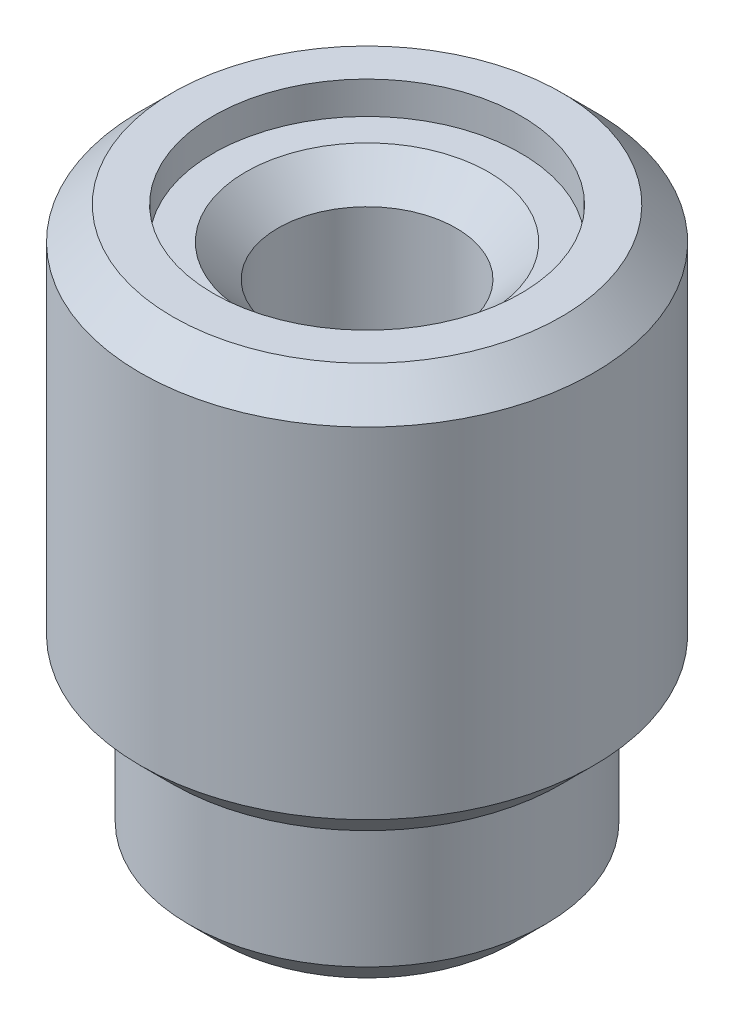
ISO-10303-21;
HEADER;
FILE_DESCRIPTION(('STEP AP214'),'2;1');
FILE_NAME('part.step','',(''),(''),'','','');
FILE_SCHEMA(('AUTOMOTIVE_DESIGN { 1 0 10303 214 1 1 1 1 }'));
ENDSEC;
DATA;
#1=APPLICATION_CONTEXT('core data for automotive mechanical design processes');
#2=APPLICATION_PROTOCOL_DEFINITION('international standard','automotive_design',2000,#1);
#3=PRODUCT_CONTEXT('',#1,'mechanical');
#4=PRODUCT('Part','Part','',(#3));
#5=PRODUCT_RELATED_PRODUCT_CATEGORY('part','',(#4));
#6=PRODUCT_DEFINITION_FORMATION('','',#4);
#7=PRODUCT_DEFINITION_CONTEXT('part definition',#1,'design');
#8=PRODUCT_DEFINITION('design','',#6,#7);
#9=PRODUCT_DEFINITION_SHAPE('','',#8);
#10=(LENGTH_UNIT() NAMED_UNIT(*) SI_UNIT(.MILLI.,.METRE.));
#11=(NAMED_UNIT(*) PLANE_ANGLE_UNIT() SI_UNIT($,.RADIAN.));
#12=(NAMED_UNIT(*) SI_UNIT($,.STERADIAN.) SOLID_ANGLE_UNIT());
#13=UNCERTAINTY_MEASURE_WITH_UNIT(LENGTH_MEASURE(1.E-05),#10,'distance_accuracy_value','');
#14=(GEOMETRIC_REPRESENTATION_CONTEXT(3) GLOBAL_UNCERTAINTY_ASSIGNED_CONTEXT((#13)) GLOBAL_UNIT_ASSIGNED_CONTEXT((#10,
#11,#12)) REPRESENTATION_CONTEXT('',''));
#15=CARTESIAN_POINT('',(0.,0.,0.));
#16=DIRECTION('',(0.,0.,1.));
#17=DIRECTION('',(1.,0.,0.));
#18=AXIS2_PLACEMENT_3D('',#15,#16,#17);
#19=CARTESIAN_POINT('',(0.,0.,0.));
#20=DIRECTION('',(0.,1.,0.));
#21=DIRECTION('',(0.,0.,1.));
#22=AXIS2_PLACEMENT_3D('',#19,#20,#21);
#23=CYLINDRICAL_SURFACE('',#22,1.397);
#24=CARTESIAN_POINT('',(0.,7.874,0.));
#25=DIRECTION('',(0.,1.,0.));
#26=DIRECTION('',(0.,0.,1.));
#27=AXIS2_PLACEMENT_3D('',#24,#25,#26);
#28=CIRCLE('',#27,1.397);
#29=CARTESIAN_POINT('',(0.,7.874,1.397));
#30=VERTEX_POINT('',#29);
#31=EDGE_CURVE('E11',#30,#30,#28,.T.);
#32=ORIENTED_EDGE('',*,*,#31,.T.);
#33=EDGE_LOOP('',(#32));
#34=FACE_BOUND('',#33,.T.);
#35=CARTESIAN_POINT('',(0.,5.08,0.));
#36=DIRECTION('',(0.,-1.,0.));
#37=DIRECTION('',(0.,0.,-1.));
#38=AXIS2_PLACEMENT_3D('',#35,#36,#37);
#39=CIRCLE('',#38,1.397);
#40=CARTESIAN_POINT('',(0.,5.08,-1.397));
#41=VERTEX_POINT('',#40);
#42=EDGE_CURVE('E95',#41,#41,#39,.F.);
#43=ORIENTED_EDGE('',*,*,#42,.F.);
#44=EDGE_LOOP('',(#43));
#45=FACE_BOUND('',#44,.T.);
#46=ADVANCED_FACE('F56',(#34,#45),#23,.F.);
#47=CARTESIAN_POINT('',(0.,2.54,0.));
#48=DIRECTION('',(0.,-1.,0.));
#49=DIRECTION('',(0.,0.,-1.));
#50=AXIS2_PLACEMENT_3D('',#47,#48,#49);
#51=CYLINDRICAL_SURFACE('',#50,2.794);
#52=CARTESIAN_POINT('',(0.,0.507999999999998,0.));
#53=DIRECTION('',(0.,1.,0.));
#54=DIRECTION('',(0.,0.,1.));
#55=AXIS2_PLACEMENT_3D('',#52,#53,#54);
#56=CIRCLE('',#55,2.794);
#57=CARTESIAN_POINT('',(0.,0.507999999999998,2.794));
#58=VERTEX_POINT('',#57);
#59=EDGE_CURVE('E91',#58,#58,#56,.T.);
#60=ORIENTED_EDGE('',*,*,#59,.T.);
#61=EDGE_LOOP('',(#60));
#62=FACE_BOUND('',#61,.T.);
#63=CARTESIAN_POINT('',(0.,2.54,0.));
#64=DIRECTION('',(0.,1.,0.));
#65=DIRECTION('',(0.,0.,1.));
#66=AXIS2_PLACEMENT_3D('',#63,#64,#65);
#67=CIRCLE('',#66,2.794);
#68=CARTESIAN_POINT('',(0.,2.54,2.794));
#69=VERTEX_POINT('',#68);
#70=EDGE_CURVE('E94',#69,#69,#67,.T.);
#71=ORIENTED_EDGE('',*,*,#70,.F.);
#72=EDGE_LOOP('',(#71));
#73=FACE_BOUND('',#72,.T.);
#74=ADVANCED_FACE('F129',(#62,#73),#51,.T.);
#75=CARTESIAN_POINT('',(0.,0.,0.));
#76=DIRECTION('',(0.,1.,0.));
#77=DIRECTION('',(0.,0.,1.));
#78=AXIS2_PLACEMENT_3D('',#75,#76,#77);
#79=PLANE('',#78);
#80=CARTESIAN_POINT('',(0.,0.,0.));
#81=DIRECTION('',(0.,1.,0.));
#82=DIRECTION('',(0.,0.,1.));
#83=AXIS2_PLACEMENT_3D('',#80,#81,#82);
#84=CIRCLE('',#83,2.2479);
#85=CARTESIAN_POINT('',(0.,0.,2.2479));
#86=VERTEX_POINT('',#85);
#87=EDGE_CURVE('E67',#86,#86,#84,.T.);
#88=ORIENTED_EDGE('',*,*,#87,.T.);
#89=EDGE_LOOP('',(#88));
#90=FACE_BOUND('',#89,.T.);
#91=CARTESIAN_POINT('',(0.,0.,0.));
#92=DIRECTION('',(0.,1.,0.));
#93=DIRECTION('',(0.,0.,1.));
#94=AXIS2_PLACEMENT_3D('',#91,#92,#93);
#95=CIRCLE('',#94,2.286);
#96=CARTESIAN_POINT('',(0.,0.,2.286));
#97=VERTEX_POINT('',#96);
#98=EDGE_CURVE('E88',#97,#97,#95,.F.);
#99=ORIENTED_EDGE('',*,*,#98,.T.);
#100=EDGE_LOOP('',(#99));
#101=FACE_BOUND('',#100,.T.);
#102=ADVANCED_FACE('F134',(#90,#101),#79,.F.);
#103=CARTESIAN_POINT('',(0.,2.54,0.));
#104=DIRECTION('',(0.,1.,0.));
#105=DIRECTION('',(0.,0.,1.));
#106=AXIS2_PLACEMENT_3D('',#103,#104,#105);
#107=PLANE('',#106);
#108=CARTESIAN_POINT('',(0.,2.54,0.));
#109=DIRECTION('',(0.,1.,0.));
#110=DIRECTION('',(0.,0.,1.));
#111=AXIS2_PLACEMENT_3D('',#108,#109,#110);
#112=CIRCLE('',#111,3.048);
#113=CARTESIAN_POINT('',(0.,2.54,3.048));
#114=VERTEX_POINT('',#113);
#115=EDGE_CURVE('E79',#114,#114,#112,.F.);
#116=ORIENTED_EDGE('',*,*,#115,.T.);
#117=EDGE_LOOP('',(#116));
#118=FACE_BOUND('',#117,.T.);
#119=ORIENTED_EDGE('',*,*,#70,.T.);
#120=EDGE_LOOP('',(#119));
#121=FACE_BOUND('',#120,.T.);
#122=ADVANCED_FACE('F146',(#118,#121),#107,.F.);
#123=CARTESIAN_POINT('',(0.,8.89,0.));
#124=DIRECTION('',(0.,-1.,0.));
#125=DIRECTION('',(0.,0.,-1.));
#126=AXIS2_PLACEMENT_3D('',#123,#124,#125);
#127=CYLINDRICAL_SURFACE('',#126,3.556);
#128=CARTESIAN_POINT('',(0.,3.048,0.));
#129=DIRECTION('',(0.,1.,0.));
#130=DIRECTION('',(0.,0.,1.));
#131=AXIS2_PLACEMENT_3D('',#128,#129,#130);
#132=CIRCLE('',#131,3.556);
#133=CARTESIAN_POINT('',(0.,3.048,3.556));
#134=VERTEX_POINT('',#133);
#135=EDGE_CURVE('E82',#134,#134,#132,.T.);
#136=ORIENTED_EDGE('',*,*,#135,.T.);
#137=EDGE_LOOP('',(#136));
#138=FACE_BOUND('',#137,.T.);
#139=CARTESIAN_POINT('',(0.,8.382,0.));
#140=DIRECTION('',(0.,1.,0.));
#141=DIRECTION('',(0.,0.,1.));
#142=AXIS2_PLACEMENT_3D('',#139,#140,#141);
#143=CIRCLE('',#142,3.556);
#144=CARTESIAN_POINT('',(0.,8.382,3.556));
#145=VERTEX_POINT('',#144);
#146=EDGE_CURVE('E85',#145,#145,#143,.F.);
#147=ORIENTED_EDGE('',*,*,#146,.T.);
#148=EDGE_LOOP('',(#147));
#149=FACE_BOUND('',#148,.T.);
#150=ADVANCED_FACE('F144',(#138,#149),#127,.T.);
#151=CARTESIAN_POINT('',(0.,8.89,0.));
#152=DIRECTION('',(0.,1.,0.));
#153=DIRECTION('',(0.,0.,1.));
#154=AXIS2_PLACEMENT_3D('',#151,#152,#153);
#155=PLANE('',#154);
#156=CARTESIAN_POINT('',(0.,8.89,0.));
#157=DIRECTION('',(0.,1.,0.));
#158=DIRECTION('',(0.,0.,1.));
#159=AXIS2_PLACEMENT_3D('',#156,#157,#158);
#160=CIRCLE('',#159,3.048);
#161=CARTESIAN_POINT('',(0.,8.89,3.048));
#162=VERTEX_POINT('',#161);
#163=EDGE_CURVE('E76',#162,#162,#160,.T.);
#164=ORIENTED_EDGE('',*,*,#163,.T.);
#165=EDGE_LOOP('',(#164));
#166=FACE_BOUND('',#165,.T.);
#167=CARTESIAN_POINT('',(0.,8.89,0.));
#168=DIRECTION('',(0.,1.,0.));
#169=DIRECTION('',(0.,0.,1.));
#170=AXIS2_PLACEMENT_3D('',#167,#168,#169);
#171=CIRCLE('',#170,2.413);
#172=CARTESIAN_POINT('',(0.,8.89,2.413));
#173=VERTEX_POINT('',#172);
#174=EDGE_CURVE('E98',#173,#173,#171,.T.);
#175=ORIENTED_EDGE('',*,*,#174,.F.);
#176=EDGE_LOOP('',(#175));
#177=FACE_BOUND('',#176,.T.);
#178=ADVANCED_FACE('F140',(#166,#177),#155,.T.);
#179=CARTESIAN_POINT('',(0.,8.382,0.));
#180=DIRECTION('',(0.,1.,0.));
#181=DIRECTION('',(0.,0.,1.));
#182=AXIS2_PLACEMENT_3D('',#179,#180,#181);
#183=PLANE('',#182);
#184=CARTESIAN_POINT('',(0.,8.382,0.));
#185=DIRECTION('',(0.,1.,0.));
#186=DIRECTION('',(0.,0.,1.));
#187=AXIS2_PLACEMENT_3D('',#184,#185,#186);
#188=CIRCLE('',#187,1.90499999999999);
#189=CARTESIAN_POINT('',(0.,8.382,1.90499999999999));
#190=VERTEX_POINT('',#189);
#191=EDGE_CURVE('E63',#190,#190,#188,.F.);
#192=ORIENTED_EDGE('',*,*,#191,.T.);
#193=EDGE_LOOP('',(#192));
#194=FACE_BOUND('',#193,.T.);
#195=CARTESIAN_POINT('',(0.,8.382,0.));
#196=DIRECTION('',(0.,1.,0.));
#197=DIRECTION('',(0.,0.,1.));
#198=AXIS2_PLACEMENT_3D('',#195,#196,#197);
#199=CIRCLE('',#198,2.413);
#200=CARTESIAN_POINT('',(0.,8.382,2.413));
#201=VERTEX_POINT('',#200);
#202=EDGE_CURVE('E102',#201,#201,#199,.T.);
#203=ORIENTED_EDGE('',*,*,#202,.T.);
#204=EDGE_LOOP('',(#203));
#205=FACE_BOUND('',#204,.T.);
#206=ADVANCED_FACE('F143',(#194,#205),#183,.T.);
#207=CARTESIAN_POINT('',(0.,8.382,0.));
#208=DIRECTION('',(0.,1.,0.));
#209=DIRECTION('',(0.,0.,1.));
#210=AXIS2_PLACEMENT_3D('',#207,#208,#209);
#211=CYLINDRICAL_SURFACE('',#210,2.413);
#212=ORIENTED_EDGE('',*,*,#202,.F.);
#213=EDGE_LOOP('',(#212));
#214=FACE_BOUND('',#213,.T.);
#215=ORIENTED_EDGE('',*,*,#174,.T.);
#216=EDGE_LOOP('',(#215));
#217=FACE_BOUND('',#216,.T.);
#218=ADVANCED_FACE('F125',(#214,#217),#211,.F.);
#219=CARTESIAN_POINT('',(0.,5.08,0.));
#220=DIRECTION('',(0.,-1.,0.));
#221=DIRECTION('',(0.,0.,-1.));
#222=AXIS2_PLACEMENT_3D('',#219,#220,#221);
#223=PLANE('',#222);
#224=CARTESIAN_POINT('',(0.,5.08,0.));
#225=DIRECTION('',(0.,-1.,0.));
#226=DIRECTION('',(0.,0.,-1.));
#227=AXIS2_PLACEMENT_3D('',#224,#225,#226);
#228=CIRCLE('',#227,1.9939);
#229=CARTESIAN_POINT('',(0.,5.08,-1.9939));
#230=VERTEX_POINT('',#229);
#231=EDGE_CURVE('E99',#230,#230,#228,.T.);
#232=ORIENTED_EDGE('',*,*,#231,.T.);
#233=EDGE_LOOP('',(#232));
#234=FACE_BOUND('',#233,.T.);
#235=ORIENTED_EDGE('',*,*,#42,.T.);
#236=EDGE_LOOP('',(#235));
#237=FACE_BOUND('',#236,.T.);
#238=ADVANCED_FACE('F110',(#234,#237),#223,.T.);
#239=CARTESIAN_POINT('',(0.,5.08,0.));
#240=DIRECTION('',(0.,-1.,0.));
#241=DIRECTION('',(0.,0.,-1.));
#242=AXIS2_PLACEMENT_3D('',#239,#240,#241);
#243=CYLINDRICAL_SURFACE('',#242,1.9939);
#244=CARTESIAN_POINT('',(0.,0.254000000000004,0.));
#245=DIRECTION('',(0.,1.,0.));
#246=DIRECTION('',(0.,0.,1.));
#247=AXIS2_PLACEMENT_3D('',#244,#245,#246);
#248=CIRCLE('',#247,1.9939);
#249=CARTESIAN_POINT('',(0.,0.254000000000004,1.9939));
#250=VERTEX_POINT('',#249);
#251=EDGE_CURVE('E71',#250,#250,#248,.F.);
#252=ORIENTED_EDGE('',*,*,#251,.T.);
#253=EDGE_LOOP('',(#252));
#254=FACE_BOUND('',#253,.T.);
#255=ORIENTED_EDGE('',*,*,#231,.F.);
#256=EDGE_LOOP('',(#255));
#257=FACE_BOUND('',#256,.T.);
#258=ADVANCED_FACE('F113',(#254,#257),#243,.F.);
#259=CARTESIAN_POINT('',(0.,0.507999999999998,0.));
#260=DIRECTION('',(0.,1.,0.));
#261=DIRECTION('',(0.,0.,1.));
#262=AXIS2_PLACEMENT_3D('',#259,#260,#261);
#263=CONICAL_SURFACE('',#262,2.794,0.78539816339745);
#264=ORIENTED_EDGE('',*,*,#98,.F.);
#265=EDGE_LOOP('',(#264));
#266=FACE_BOUND('',#265,.T.);
#267=ORIENTED_EDGE('',*,*,#59,.F.);
#268=EDGE_LOOP('',(#267));
#269=FACE_BOUND('',#268,.T.);
#270=ADVANCED_FACE('F115',(#266,#269),#263,.T.);
#271=CARTESIAN_POINT('',(0.,3.048,0.));
#272=DIRECTION('',(0.,1.,0.));
#273=DIRECTION('',(0.,0.,1.));
#274=AXIS2_PLACEMENT_3D('',#271,#272,#273);
#275=CONICAL_SURFACE('',#274,3.556,0.78539816339745);
#276=ORIENTED_EDGE('',*,*,#115,.F.);
#277=EDGE_LOOP('',(#276));
#278=FACE_BOUND('',#277,.T.);
#279=ORIENTED_EDGE('',*,*,#135,.F.);
#280=EDGE_LOOP('',(#279));
#281=FACE_BOUND('',#280,.T.);
#282=ADVANCED_FACE('F122',(#278,#281),#275,.T.);
#283=CARTESIAN_POINT('',(0.,8.89,0.));
#284=DIRECTION('',(0.,-1.,0.));
#285=DIRECTION('',(0.,0.,-1.));
#286=AXIS2_PLACEMENT_3D('',#283,#284,#285);
#287=CONICAL_SURFACE('',#286,3.048,0.785398163397447);
#288=ORIENTED_EDGE('',*,*,#146,.F.);
#289=EDGE_LOOP('',(#288));
#290=FACE_BOUND('',#289,.T.);
#291=ORIENTED_EDGE('',*,*,#163,.F.);
#292=EDGE_LOOP('',(#291));
#293=FACE_BOUND('',#292,.T.);
#294=ADVANCED_FACE('F158',(#290,#293),#287,.T.);
#295=CARTESIAN_POINT('',(0.,0.254000000000004,0.));
#296=DIRECTION('',(0.,-1.,0.));
#297=DIRECTION('',(0.,0.,-1.));
#298=AXIS2_PLACEMENT_3D('',#295,#296,#297);
#299=CONICAL_SURFACE('',#298,1.9939,0.785398163397448);
#300=ORIENTED_EDGE('',*,*,#87,.F.);
#301=EDGE_LOOP('',(#300));
#302=FACE_BOUND('',#301,.T.);
#303=ORIENTED_EDGE('',*,*,#251,.F.);
#304=EDGE_LOOP('',(#303));
#305=FACE_BOUND('',#304,.T.);
#306=ADVANCED_FACE('F161',(#302,#305),#299,.F.);
#307=CARTESIAN_POINT('',(0.,8.382,0.));
#308=DIRECTION('',(0.,1.,0.));
#309=DIRECTION('',(0.,0.,1.));
#310=AXIS2_PLACEMENT_3D('',#307,#308,#309);
#311=CONICAL_SURFACE('',#310,1.90499999999999,0.785398163397445);
#312=ORIENTED_EDGE('',*,*,#31,.F.);
#313=EDGE_LOOP('',(#312));
#314=FACE_BOUND('',#313,.T.);
#315=ORIENTED_EDGE('',*,*,#191,.F.);
#316=EDGE_LOOP('',(#315));
#317=FACE_BOUND('',#316,.T.);
#318=ADVANCED_FACE('F58',(#314,#317),#311,.F.);
#319=CLOSED_SHELL('',(#46,#74,#102,#122,#150,#178,#206,#218,#238,#258,#270,#282,#294,#306,#318));
#320=MANIFOLD_SOLID_BREP('B2',#319);
#321=ADVANCED_BREP_SHAPE_REPRESENTATION('',(#18,#320),#14);
#322=SHAPE_DEFINITION_REPRESENTATION(#9,#321);
ENDSEC;
END-ISO-10303-21;
